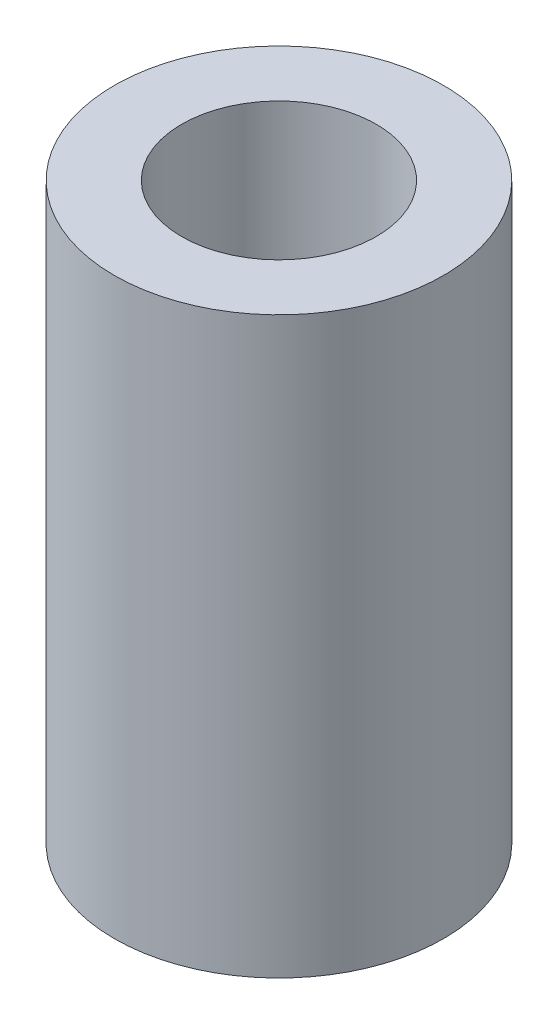
ISO-10303-21;
HEADER;
FILE_DESCRIPTION(('STEP AP214'),'2;1');
FILE_NAME('part.step','',(''),(''),'','','');
FILE_SCHEMA(('AUTOMOTIVE_DESIGN { 1 0 10303 214 1 1 1 1 }'));
ENDSEC;
DATA;
#1=APPLICATION_CONTEXT('core data for automotive mechanical design processes');
#2=APPLICATION_PROTOCOL_DEFINITION('international standard','automotive_design',2000,#1);
#3=PRODUCT_CONTEXT('',#1,'mechanical');
#4=PRODUCT('Part','Part','',(#3));
#5=PRODUCT_RELATED_PRODUCT_CATEGORY('part','',(#4));
#6=PRODUCT_DEFINITION_FORMATION('','',#4);
#7=PRODUCT_DEFINITION_CONTEXT('part definition',#1,'design');
#8=PRODUCT_DEFINITION('design','',#6,#7);
#9=PRODUCT_DEFINITION_SHAPE('','',#8);
#10=(LENGTH_UNIT() NAMED_UNIT(*) SI_UNIT(.MILLI.,.METRE.));
#11=(NAMED_UNIT(*) PLANE_ANGLE_UNIT() SI_UNIT($,.RADIAN.));
#12=(NAMED_UNIT(*) SI_UNIT($,.STERADIAN.) SOLID_ANGLE_UNIT());
#13=UNCERTAINTY_MEASURE_WITH_UNIT(LENGTH_MEASURE(1.E-05),#10,'distance_accuracy_value','');
#14=(GEOMETRIC_REPRESENTATION_CONTEXT(3) GLOBAL_UNCERTAINTY_ASSIGNED_CONTEXT((#13)) GLOBAL_UNIT_ASSIGNED_CONTEXT((#10,
#11,#12)) REPRESENTATION_CONTEXT('',''));
#15=CARTESIAN_POINT('',(0.,0.,0.));
#16=DIRECTION('',(0.,0.,1.));
#17=DIRECTION('',(1.,0.,0.));
#18=AXIS2_PLACEMENT_3D('',#15,#16,#17);
#19=CARTESIAN_POINT('',(0.,69.7779171434287,0.));
#20=DIRECTION('',(0.,-1.,0.));
#21=DIRECTION('',(0.,0.,-1.));
#22=AXIS2_PLACEMENT_3D('',#19,#20,#21);
#23=CYLINDRICAL_SURFACE('',#22,20.);
#24=CARTESIAN_POINT('',(0.,69.7779171434287,0.));
#25=DIRECTION('',(0.,1.,0.));
#26=DIRECTION('',(0.,0.,1.));
#27=AXIS2_PLACEMENT_3D('',#24,#25,#26);
#28=CIRCLE('',#27,20.);
#29=CARTESIAN_POINT('',(0.,69.7779171434287,20.));
#30=VERTEX_POINT('',#29);
#31=EDGE_CURVE('E10',#30,#30,#28,.T.);
#32=ORIENTED_EDGE('',*,*,#31,.F.);
#33=EDGE_LOOP('',(#32));
#34=FACE_BOUND('',#33,.T.);
#35=CARTESIAN_POINT('',(0.,0.,0.));
#36=DIRECTION('',(0.,1.,0.));
#37=DIRECTION('',(0.,0.,1.));
#38=AXIS2_PLACEMENT_3D('',#35,#36,#37);
#39=CIRCLE('',#38,20.);
#40=CARTESIAN_POINT('',(0.,0.,20.));
#41=VERTEX_POINT('',#40);
#42=EDGE_CURVE('E37',#41,#41,#39,.T.);
#43=ORIENTED_EDGE('',*,*,#42,.T.);
#44=EDGE_LOOP('',(#43));
#45=FACE_BOUND('',#44,.T.);
#46=ADVANCED_FACE('F40',(#34,#45),#23,.T.);
#47=CARTESIAN_POINT('',(0.,69.7779171434287,0.));
#48=DIRECTION('',(0.,1.,0.));
#49=DIRECTION('',(0.,0.,1.));
#50=AXIS2_PLACEMENT_3D('',#47,#48,#49);
#51=PLANE('',#50);
#52=CARTESIAN_POINT('',(0.,69.7779171434287,0.));
#53=DIRECTION('',(0.,1.,0.));
#54=DIRECTION('',(0.,0.,1.));
#55=AXIS2_PLACEMENT_3D('',#52,#53,#54);
#56=CIRCLE('',#55,11.8241204729852);
#57=CARTESIAN_POINT('',(0.,69.7779171434287,11.8241204729852));
#58=VERTEX_POINT('',#57);
#59=EDGE_CURVE('E50',#58,#58,#56,.T.);
#60=ORIENTED_EDGE('',*,*,#59,.F.);
#61=EDGE_LOOP('',(#60));
#62=FACE_BOUND('',#61,.T.);
#63=ORIENTED_EDGE('',*,*,#31,.T.);
#64=EDGE_LOOP('',(#63));
#65=FACE_BOUND('',#64,.T.);
#66=ADVANCED_FACE('F59',(#62,#65),#51,.T.);
#67=CARTESIAN_POINT('',(0.,0.,0.));
#68=DIRECTION('',(0.,1.,0.));
#69=DIRECTION('',(0.,0.,1.));
#70=AXIS2_PLACEMENT_3D('',#67,#68,#69);
#71=PLANE('',#70);
#72=CARTESIAN_POINT('',(0.,0.,0.));
#73=DIRECTION('',(0.,1.,0.));
#74=DIRECTION('',(0.,0.,1.));
#75=AXIS2_PLACEMENT_3D('',#72,#73,#74);
#76=CIRCLE('',#75,11.8241204729852);
#77=CARTESIAN_POINT('',(0.,0.,11.8241204729852));
#78=VERTEX_POINT('',#77);
#79=EDGE_CURVE('E47',#78,#78,#76,.T.);
#80=ORIENTED_EDGE('',*,*,#79,.T.);
#81=EDGE_LOOP('',(#80));
#82=FACE_BOUND('',#81,.T.);
#83=ORIENTED_EDGE('',*,*,#42,.F.);
#84=EDGE_LOOP('',(#83));
#85=FACE_BOUND('',#84,.T.);
#86=ADVANCED_FACE('F58',(#82,#85),#71,.F.);
#87=CARTESIAN_POINT('',(0.,69.7779171434287,0.));
#88=DIRECTION('',(0.,-1.,0.));
#89=DIRECTION('',(0.,0.,-1.));
#90=AXIS2_PLACEMENT_3D('',#87,#88,#89);
#91=CYLINDRICAL_SURFACE('',#90,11.8241204729852);
#92=ORIENTED_EDGE('',*,*,#59,.T.);
#93=EDGE_LOOP('',(#92));
#94=FACE_BOUND('',#93,.T.);
#95=ORIENTED_EDGE('',*,*,#79,.F.);
#96=EDGE_LOOP('',(#95));
#97=FACE_BOUND('',#96,.T.);
#98=ADVANCED_FACE('F54',(#94,#97),#91,.F.);
#99=CLOSED_SHELL('',(#46,#66,#86,#98));
#100=MANIFOLD_SOLID_BREP('B2',#99);
#101=ADVANCED_BREP_SHAPE_REPRESENTATION('',(#18,#100),#14);
#102=SHAPE_DEFINITION_REPRESENTATION(#9,#101);
ENDSEC;
END-ISO-10303-21;
